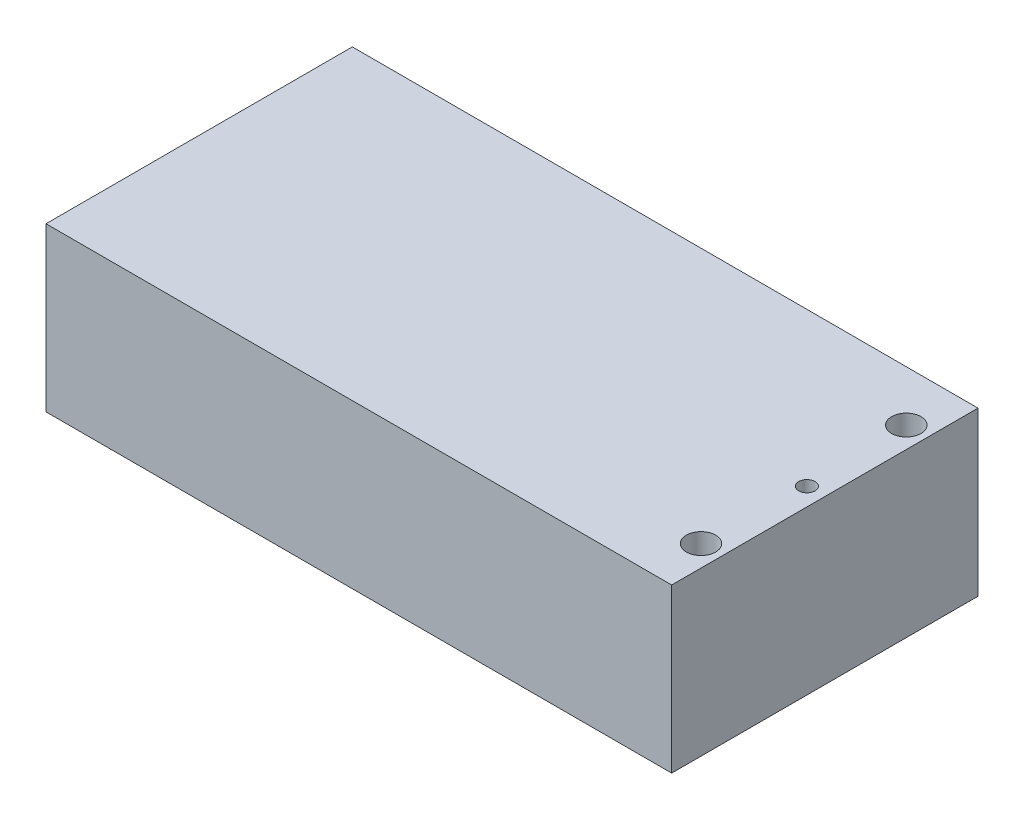
ISO-10303-21;
HEADER;
FILE_DESCRIPTION(('STEP AP214'),'2;1');
FILE_NAME('part.step','',(''),(''),'','','');
FILE_SCHEMA(('AUTOMOTIVE_DESIGN { 1 0 10303 214 1 1 1 1 }'));
ENDSEC;
DATA;
#1=APPLICATION_CONTEXT('core data for automotive mechanical design processes');
#2=APPLICATION_PROTOCOL_DEFINITION('international standard','automotive_design',2000,#1);
#3=PRODUCT_CONTEXT('',#1,'mechanical');
#4=PRODUCT('Part','Part','',(#3));
#5=PRODUCT_RELATED_PRODUCT_CATEGORY('part','',(#4));
#6=PRODUCT_DEFINITION_FORMATION('','',#4);
#7=PRODUCT_DEFINITION_CONTEXT('part definition',#1,'design');
#8=PRODUCT_DEFINITION('design','',#6,#7);
#9=PRODUCT_DEFINITION_SHAPE('','',#8);
#10=(LENGTH_UNIT() NAMED_UNIT(*) SI_UNIT(.MILLI.,.METRE.));
#11=(NAMED_UNIT(*) PLANE_ANGLE_UNIT() SI_UNIT($,.RADIAN.));
#12=(NAMED_UNIT(*) SI_UNIT($,.STERADIAN.) SOLID_ANGLE_UNIT());
#13=UNCERTAINTY_MEASURE_WITH_UNIT(LENGTH_MEASURE(1.E-05),#10,'distance_accuracy_value','');
#14=(GEOMETRIC_REPRESENTATION_CONTEXT(3) GLOBAL_UNCERTAINTY_ASSIGNED_CONTEXT((#13)) GLOBAL_UNIT_ASSIGNED_CONTEXT((#10,
#11,#12)) REPRESENTATION_CONTEXT('',''));
#15=CARTESIAN_POINT('',(0.,0.,0.));
#16=DIRECTION('',(0.,0.,1.));
#17=DIRECTION('',(1.,0.,0.));
#18=AXIS2_PLACEMENT_3D('',#15,#16,#17);
#19=CARTESIAN_POINT('',(48.,25.,23.5));
#20=DIRECTION('',(-1.,0.,0.));
#21=DIRECTION('',(0.,0.,1.));
#22=AXIS2_PLACEMENT_3D('',#19,#20,#21);
#23=PLANE('',#22);
#24=DIRECTION('',(0.,0.,-1.));
#25=VECTOR('',#24,1.);
#26=CARTESIAN_POINT('',(48.,0.,23.5));
#27=LINE('',#26,#25);
#28=CARTESIAN_POINT('',(48.,0.,23.5));
#29=VERTEX_POINT('',#28);
#30=CARTESIAN_POINT('',(48.,0.,-23.5));
#31=VERTEX_POINT('',#30);
#32=EDGE_CURVE('E115',#29,#31,#27,.T.);
#33=ORIENTED_EDGE('',*,*,#32,.T.);
#34=DIRECTION('',(0.,-1.,0.));
#35=VECTOR('',#34,1.);
#36=CARTESIAN_POINT('',(48.,25.,-23.5));
#37=LINE('',#36,#35);
#38=CARTESIAN_POINT('',(48.,25.,-23.5));
#39=VERTEX_POINT('',#38);
#40=EDGE_CURVE('E11',#39,#31,#37,.T.);
#41=ORIENTED_EDGE('',*,*,#40,.F.);
#42=DIRECTION('',(0.,0.,-1.));
#43=VECTOR('',#42,1.);
#44=CARTESIAN_POINT('',(48.,25.,23.5));
#45=LINE('',#44,#43);
#46=CARTESIAN_POINT('',(48.,25.,23.5));
#47=VERTEX_POINT('',#46);
#48=EDGE_CURVE('E99',#47,#39,#45,.T.);
#49=ORIENTED_EDGE('',*,*,#48,.F.);
#50=DIRECTION('',(0.,-1.,0.));
#51=VECTOR('',#50,1.);
#52=CARTESIAN_POINT('',(48.,25.,23.5));
#53=LINE('',#52,#51);
#54=EDGE_CURVE('E111',#47,#29,#53,.T.);
#55=ORIENTED_EDGE('',*,*,#54,.T.);
#56=EDGE_LOOP('',(#33,#41,#49,#55));
#57=FACE_BOUND('',#56,.T.);
#58=ADVANCED_FACE('F47',(#57),#23,.F.);
#59=CARTESIAN_POINT('',(-48.,25.,-23.5));
#60=DIRECTION('',(0.,0.,1.));
#61=DIRECTION('',(1.,0.,0.));
#62=AXIS2_PLACEMENT_3D('',#59,#60,#61);
#63=PLANE('',#62);
#64=DIRECTION('',(-1.,0.,0.));
#65=VECTOR('',#64,1.);
#66=CARTESIAN_POINT('',(-48.,0.,-23.5));
#67=LINE('',#66,#65);
#68=CARTESIAN_POINT('',(-48.,0.,-23.5));
#69=VERTEX_POINT('',#68);
#70=EDGE_CURVE('E104',#31,#69,#67,.T.);
#71=ORIENTED_EDGE('',*,*,#70,.T.);
#72=DIRECTION('',(0.,-1.,0.));
#73=VECTOR('',#72,1.);
#74=CARTESIAN_POINT('',(-48.,25.,-23.5));
#75=LINE('',#74,#73);
#76=CARTESIAN_POINT('',(-48.,25.,-23.5));
#77=VERTEX_POINT('',#76);
#78=EDGE_CURVE('E56',#77,#69,#75,.T.);
#79=ORIENTED_EDGE('',*,*,#78,.F.);
#80=DIRECTION('',(-1.,0.,0.));
#81=VECTOR('',#80,1.);
#82=CARTESIAN_POINT('',(-48.,25.,-23.5));
#83=LINE('',#82,#81);
#84=EDGE_CURVE('E94',#39,#77,#83,.T.);
#85=ORIENTED_EDGE('',*,*,#84,.F.);
#86=ORIENTED_EDGE('',*,*,#40,.T.);
#87=EDGE_LOOP('',(#71,#79,#85,#86));
#88=FACE_BOUND('',#87,.T.);
#89=ADVANCED_FACE('F103',(#88),#63,.F.);
#90=CARTESIAN_POINT('',(-48.,25.,23.5));
#91=DIRECTION('',(1.,0.,0.));
#92=DIRECTION('',(0.,0.,-1.));
#93=AXIS2_PLACEMENT_3D('',#90,#91,#92);
#94=PLANE('',#93);
#95=DIRECTION('',(0.,0.,1.));
#96=VECTOR('',#95,1.);
#97=CARTESIAN_POINT('',(-48.,0.,23.5));
#98=LINE('',#97,#96);
#99=CARTESIAN_POINT('',(-48.,0.,23.5));
#100=VERTEX_POINT('',#99);
#101=EDGE_CURVE('E81',#69,#100,#98,.T.);
#102=ORIENTED_EDGE('',*,*,#101,.T.);
#103=DIRECTION('',(0.,-1.,0.));
#104=VECTOR('',#103,1.);
#105=CARTESIAN_POINT('',(-48.,25.,23.5));
#106=LINE('',#105,#104);
#107=CARTESIAN_POINT('',(-48.,25.,23.5));
#108=VERTEX_POINT('',#107);
#109=EDGE_CURVE('E106',#108,#100,#106,.T.);
#110=ORIENTED_EDGE('',*,*,#109,.F.);
#111=DIRECTION('',(0.,0.,1.));
#112=VECTOR('',#111,1.);
#113=CARTESIAN_POINT('',(-48.,25.,23.5));
#114=LINE('',#113,#112);
#115=EDGE_CURVE('E97',#77,#108,#114,.T.);
#116=ORIENTED_EDGE('',*,*,#115,.F.);
#117=ORIENTED_EDGE('',*,*,#78,.T.);
#118=EDGE_LOOP('',(#102,#110,#116,#117));
#119=FACE_BOUND('',#118,.T.);
#120=ADVANCED_FACE('F107',(#119),#94,.F.);
#121=CARTESIAN_POINT('',(-48.,25.,23.5));
#122=DIRECTION('',(0.,0.,-1.));
#123=DIRECTION('',(-1.,0.,0.));
#124=AXIS2_PLACEMENT_3D('',#121,#122,#123);
#125=PLANE('',#124);
#126=DIRECTION('',(1.,0.,0.));
#127=VECTOR('',#126,1.);
#128=CARTESIAN_POINT('',(-48.,0.,23.5));
#129=LINE('',#128,#127);
#130=EDGE_CURVE('E87',#100,#29,#129,.T.);
#131=ORIENTED_EDGE('',*,*,#130,.T.);
#132=ORIENTED_EDGE('',*,*,#54,.F.);
#133=DIRECTION('',(1.,0.,0.));
#134=VECTOR('',#133,1.);
#135=CARTESIAN_POINT('',(-48.,25.,23.5));
#136=LINE('',#135,#134);
#137=EDGE_CURVE('E64',#108,#47,#136,.T.);
#138=ORIENTED_EDGE('',*,*,#137,.F.);
#139=ORIENTED_EDGE('',*,*,#109,.T.);
#140=EDGE_LOOP('',(#131,#132,#138,#139));
#141=FACE_BOUND('',#140,.T.);
#142=ADVANCED_FACE('F129',(#141),#125,.F.);
#143=CARTESIAN_POINT('',(0.,25.,0.));
#144=DIRECTION('',(0.,-1.,0.));
#145=DIRECTION('',(0.,0.,-1.));
#146=AXIS2_PLACEMENT_3D('',#143,#144,#145);
#147=PLANE('',#146);
#148=CARTESIAN_POINT('',(44.75,25.,-15.75));
#149=DIRECTION('',(0.,1.,0.));
#150=DIRECTION('',(0.,0.,1.));
#151=AXIS2_PLACEMENT_3D('',#148,#149,#150);
#152=CIRCLE('',#151,2.25);
#153=CARTESIAN_POINT('',(44.75,25.,-13.5));
#154=VERTEX_POINT('',#153);
#155=EDGE_CURVE('E152',#154,#154,#152,.T.);
#156=ORIENTED_EDGE('',*,*,#155,.F.);
#157=EDGE_LOOP('',(#156));
#158=FACE_BOUND('',#157,.T.);
#159=CARTESIAN_POINT('',(44.75,25.,15.75));
#160=DIRECTION('',(0.,1.,0.));
#161=DIRECTION('',(0.,0.,1.));
#162=AXIS2_PLACEMENT_3D('',#159,#160,#161);
#163=CIRCLE('',#162,2.25);
#164=CARTESIAN_POINT('',(44.75,25.,18.));
#165=VERTEX_POINT('',#164);
#166=EDGE_CURVE('E148',#165,#165,#163,.T.);
#167=ORIENTED_EDGE('',*,*,#166,.F.);
#168=EDGE_LOOP('',(#167));
#169=FACE_BOUND('',#168,.T.);
#170=CARTESIAN_POINT('',(45.25,25.,0.));
#171=DIRECTION('',(0.,1.,0.));
#172=DIRECTION('',(0.,0.,1.));
#173=AXIS2_PLACEMENT_3D('',#170,#171,#172);
#174=CIRCLE('',#173,1.25);
#175=CARTESIAN_POINT('',(45.25,25.,1.25));
#176=VERTEX_POINT('',#175);
#177=EDGE_CURVE('E140',#176,#176,#174,.T.);
#178=ORIENTED_EDGE('',*,*,#177,.F.);
#179=EDGE_LOOP('',(#178));
#180=FACE_BOUND('',#179,.T.);
#181=ORIENTED_EDGE('',*,*,#48,.T.);
#182=ORIENTED_EDGE('',*,*,#84,.T.);
#183=ORIENTED_EDGE('',*,*,#115,.T.);
#184=ORIENTED_EDGE('',*,*,#137,.T.);
#185=EDGE_LOOP('',(#181,#182,#183,#184));
#186=FACE_BOUND('',#185,.T.);
#187=ADVANCED_FACE('F95',(#158,#169,#180,#186),#147,.F.);
#188=CARTESIAN_POINT('',(0.,0.,0.));
#189=DIRECTION('',(0.,-1.,0.));
#190=DIRECTION('',(0.,0.,-1.));
#191=AXIS2_PLACEMENT_3D('',#188,#189,#190);
#192=PLANE('',#191);
#193=ORIENTED_EDGE('',*,*,#32,.F.);
#194=ORIENTED_EDGE('',*,*,#130,.F.);
#195=ORIENTED_EDGE('',*,*,#101,.F.);
#196=ORIENTED_EDGE('',*,*,#70,.F.);
#197=EDGE_LOOP('',(#193,#194,#195,#196));
#198=FACE_BOUND('',#197,.T.);
#199=ADVANCED_FACE('F132',(#198),#192,.T.);
#200=CARTESIAN_POINT('',(45.25,15.,0.));
#201=DIRECTION('',(0.,1.,0.));
#202=DIRECTION('',(0.,0.,1.));
#203=AXIS2_PLACEMENT_3D('',#200,#201,#202);
#204=CYLINDRICAL_SURFACE('',#203,1.25);
#205=CARTESIAN_POINT('',(45.25,15.,0.));
#206=DIRECTION('',(0.,1.,0.));
#207=DIRECTION('',(0.,0.,1.));
#208=AXIS2_PLACEMENT_3D('',#205,#206,#207);
#209=CIRCLE('',#208,1.25);
#210=CARTESIAN_POINT('',(45.25,15.,1.25));
#211=VERTEX_POINT('',#210);
#212=EDGE_CURVE('E136',#211,#211,#209,.T.);
#213=ORIENTED_EDGE('',*,*,#212,.F.);
#214=EDGE_LOOP('',(#213));
#215=FACE_BOUND('',#214,.T.);
#216=ORIENTED_EDGE('',*,*,#177,.T.);
#217=EDGE_LOOP('',(#216));
#218=FACE_BOUND('',#217,.T.);
#219=ADVANCED_FACE('F176',(#215,#218),#204,.F.);
#220=CARTESIAN_POINT('',(45.25,15.,0.));
#221=DIRECTION('',(0.,1.,0.));
#222=DIRECTION('',(0.,0.,1.));
#223=AXIS2_PLACEMENT_3D('',#220,#221,#222);
#224=PLANE('',#223);
#225=ORIENTED_EDGE('',*,*,#212,.T.);
#226=EDGE_LOOP('',(#225));
#227=FACE_BOUND('',#226,.T.);
#228=ADVANCED_FACE('F178',(#227),#224,.T.);
#229=CARTESIAN_POINT('',(44.75,15.,15.75));
#230=DIRECTION('',(0.,1.,0.));
#231=DIRECTION('',(0.,0.,1.));
#232=AXIS2_PLACEMENT_3D('',#229,#230,#231);
#233=CYLINDRICAL_SURFACE('',#232,2.25);
#234=CARTESIAN_POINT('',(44.75,15.,15.75));
#235=DIRECTION('',(0.,1.,0.));
#236=DIRECTION('',(0.,0.,1.));
#237=AXIS2_PLACEMENT_3D('',#234,#235,#236);
#238=CIRCLE('',#237,2.25);
#239=CARTESIAN_POINT('',(44.75,15.,18.));
#240=VERTEX_POINT('',#239);
#241=EDGE_CURVE('E144',#240,#240,#238,.T.);
#242=ORIENTED_EDGE('',*,*,#241,.F.);
#243=EDGE_LOOP('',(#242));
#244=FACE_BOUND('',#243,.T.);
#245=ORIENTED_EDGE('',*,*,#166,.T.);
#246=EDGE_LOOP('',(#245));
#247=FACE_BOUND('',#246,.T.);
#248=ADVANCED_FACE('F184',(#244,#247),#233,.F.);
#249=CARTESIAN_POINT('',(44.75,15.,15.75));
#250=DIRECTION('',(0.,1.,0.));
#251=DIRECTION('',(0.,0.,1.));
#252=AXIS2_PLACEMENT_3D('',#249,#250,#251);
#253=PLANE('',#252);
#254=ORIENTED_EDGE('',*,*,#241,.T.);
#255=EDGE_LOOP('',(#254));
#256=FACE_BOUND('',#255,.T.);
#257=ADVANCED_FACE('F165',(#256),#253,.T.);
#258=CARTESIAN_POINT('',(44.75,15.,-15.75));
#259=DIRECTION('',(0.,1.,0.));
#260=DIRECTION('',(0.,0.,1.));
#261=AXIS2_PLACEMENT_3D('',#258,#259,#260);
#262=CYLINDRICAL_SURFACE('',#261,2.25);
#263=CARTESIAN_POINT('',(44.75,15.,-15.75));
#264=DIRECTION('',(0.,1.,0.));
#265=DIRECTION('',(0.,0.,1.));
#266=AXIS2_PLACEMENT_3D('',#263,#264,#265);
#267=CIRCLE('',#266,2.25);
#268=CARTESIAN_POINT('',(44.75,15.,-13.5));
#269=VERTEX_POINT('',#268);
#270=EDGE_CURVE('E119',#269,#269,#267,.T.);
#271=ORIENTED_EDGE('',*,*,#270,.F.);
#272=EDGE_LOOP('',(#271));
#273=FACE_BOUND('',#272,.T.);
#274=ORIENTED_EDGE('',*,*,#155,.T.);
#275=EDGE_LOOP('',(#274));
#276=FACE_BOUND('',#275,.T.);
#277=ADVANCED_FACE('F162',(#273,#276),#262,.F.);
#278=CARTESIAN_POINT('',(44.75,15.,-15.75));
#279=DIRECTION('',(0.,1.,0.));
#280=DIRECTION('',(0.,0.,1.));
#281=AXIS2_PLACEMENT_3D('',#278,#279,#280);
#282=PLANE('',#281);
#283=ORIENTED_EDGE('',*,*,#270,.T.);
#284=EDGE_LOOP('',(#283));
#285=FACE_BOUND('',#284,.T.);
#286=ADVANCED_FACE('F160',(#285),#282,.T.);
#287=CLOSED_SHELL('',(#58,#89,#120,#142,#187,#199,#219,#228,#248,#257,#277,#286));
#288=MANIFOLD_SOLID_BREP('B2',#287);
#289=ADVANCED_BREP_SHAPE_REPRESENTATION('',(#18,#288),#14);
#290=SHAPE_DEFINITION_REPRESENTATION(#9,#289);
ENDSEC;
END-ISO-10303-21;
